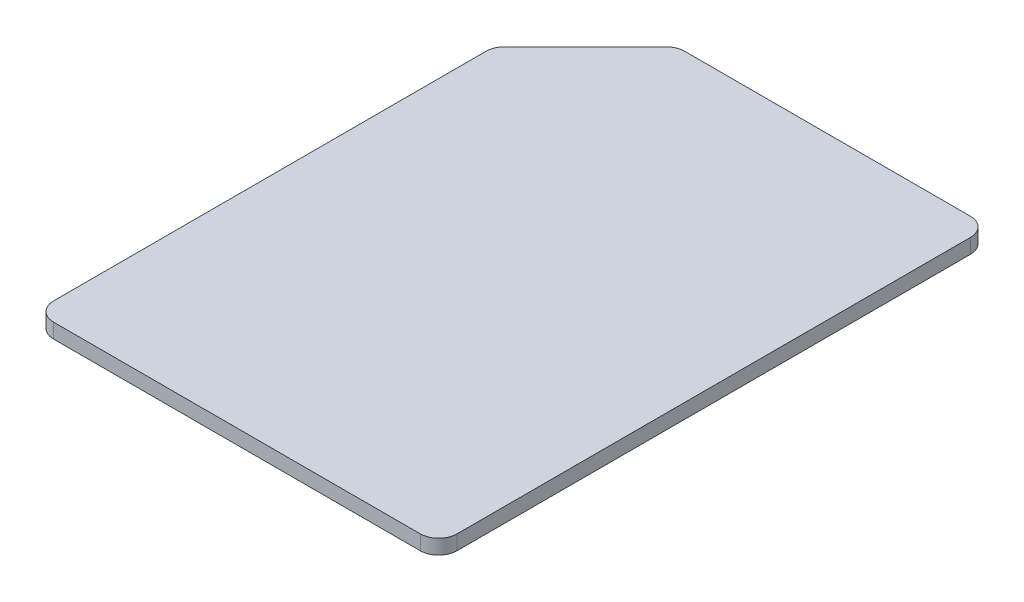
ISO-10303-21;
HEADER;
FILE_DESCRIPTION(('STEP AP214'),'2;1');
FILE_NAME('part.step','',(''),(''),'','','');
FILE_SCHEMA(('AUTOMOTIVE_DESIGN { 1 0 10303 214 1 1 1 1 }'));
ENDSEC;
DATA;
#1=APPLICATION_CONTEXT('core data for automotive mechanical design processes');
#2=APPLICATION_PROTOCOL_DEFINITION('international standard','automotive_design',2000,#1);
#3=PRODUCT_CONTEXT('',#1,'mechanical');
#4=PRODUCT('Part','Part','',(#3));
#5=PRODUCT_RELATED_PRODUCT_CATEGORY('part','',(#4));
#6=PRODUCT_DEFINITION_FORMATION('','',#4);
#7=PRODUCT_DEFINITION_CONTEXT('part definition',#1,'design');
#8=PRODUCT_DEFINITION('design','',#6,#7);
#9=PRODUCT_DEFINITION_SHAPE('','',#8);
#10=(LENGTH_UNIT() NAMED_UNIT(*) SI_UNIT(.MILLI.,.METRE.));
#11=(NAMED_UNIT(*) PLANE_ANGLE_UNIT() SI_UNIT($,.RADIAN.));
#12=(NAMED_UNIT(*) SI_UNIT($,.STERADIAN.) SOLID_ANGLE_UNIT());
#13=UNCERTAINTY_MEASURE_WITH_UNIT(LENGTH_MEASURE(1.E-05),#10,'distance_accuracy_value','');
#14=(GEOMETRIC_REPRESENTATION_CONTEXT(3) GLOBAL_UNCERTAINTY_ASSIGNED_CONTEXT((#13)) GLOBAL_UNIT_ASSIGNED_CONTEXT((#10,
#11,#12)) REPRESENTATION_CONTEXT('',''));
#15=CARTESIAN_POINT('',(0.,0.,0.));
#16=DIRECTION('',(0.,0.,1.));
#17=DIRECTION('',(1.,0.,0.));
#18=AXIS2_PLACEMENT_3D('',#15,#16,#17);
#19=CARTESIAN_POINT('',(5.5,0.4,7.5));
#20=DIRECTION('',(-1.,0.,0.));
#21=DIRECTION('',(0.,0.,1.));
#22=AXIS2_PLACEMENT_3D('',#19,#20,#21);
#23=PLANE('',#22);
#24=DIRECTION('',(0.,0.,-1.));
#25=VECTOR('',#24,1.);
#26=CARTESIAN_POINT('',(5.5,0.4,7.5));
#27=LINE('',#26,#25);
#28=CARTESIAN_POINT('',(5.5,0.4,7.));
#29=VERTEX_POINT('',#28);
#30=CARTESIAN_POINT('',(5.5,0.4,-7.));
#31=VERTEX_POINT('',#30);
#32=EDGE_CURVE('E144',#29,#31,#27,.T.);
#33=ORIENTED_EDGE('',*,*,#32,.F.);
#34=DIRECTION('',(0.,-1.,0.));
#35=VECTOR('',#34,1.);
#36=CARTESIAN_POINT('',(5.5,0.4,7.));
#37=LINE('',#36,#35);
#38=CARTESIAN_POINT('',(5.5,0.,7.));
#39=VERTEX_POINT('',#38);
#40=EDGE_CURVE('E128',#29,#39,#37,.T.);
#41=ORIENTED_EDGE('',*,*,#40,.T.);
#42=DIRECTION('',(0.,0.,-1.));
#43=VECTOR('',#42,1.);
#44=CARTESIAN_POINT('',(5.5,0.,7.5));
#45=LINE('',#44,#43);
#46=CARTESIAN_POINT('',(5.5,0.,-7.));
#47=VERTEX_POINT('',#46);
#48=EDGE_CURVE('E141',#39,#47,#45,.T.);
#49=ORIENTED_EDGE('',*,*,#48,.T.);
#50=DIRECTION('',(0.,-1.,0.));
#51=VECTOR('',#50,1.);
#52=CARTESIAN_POINT('',(5.5,0.4,-7.));
#53=LINE('',#52,#51);
#54=EDGE_CURVE('E147',#47,#31,#53,.F.);
#55=ORIENTED_EDGE('',*,*,#54,.T.);
#56=EDGE_LOOP('',(#33,#41,#49,#55));
#57=FACE_BOUND('',#56,.T.);
#58=ADVANCED_FACE('F45',(#57),#23,.F.);
#59=CARTESIAN_POINT('',(-5.5,0.4,-7.5));
#60=DIRECTION('',(0.,0.,1.));
#61=DIRECTION('',(1.,0.,0.));
#62=AXIS2_PLACEMENT_3D('',#59,#60,#61);
#63=PLANE('',#62);
#64=DIRECTION('',(-1.,0.,0.));
#65=VECTOR('',#64,1.);
#66=CARTESIAN_POINT('',(-5.5,0.4,-7.5));
#67=LINE('',#66,#65);
#68=CARTESIAN_POINT('',(5.,0.4,-7.5));
#69=VERTEX_POINT('',#68);
#70=CARTESIAN_POINT('',(-2.79289321881345,0.4,-7.5));
#71=VERTEX_POINT('',#70);
#72=EDGE_CURVE('E242',#69,#71,#67,.T.);
#73=ORIENTED_EDGE('',*,*,#72,.F.);
#74=DIRECTION('',(0.,-1.,0.));
#75=VECTOR('',#74,1.);
#76=CARTESIAN_POINT('',(5.,0.4,-7.5));
#77=LINE('',#76,#75);
#78=CARTESIAN_POINT('',(5.,0.,-7.5));
#79=VERTEX_POINT('',#78);
#80=EDGE_CURVE('E215',#69,#79,#77,.T.);
#81=ORIENTED_EDGE('',*,*,#80,.T.);
#82=DIRECTION('',(-1.,0.,0.));
#83=VECTOR('',#82,1.);
#84=CARTESIAN_POINT('',(-5.5,0.,-7.5));
#85=LINE('',#84,#83);
#86=CARTESIAN_POINT('',(-2.79289321881345,0.,-7.5));
#87=VERTEX_POINT('',#86);
#88=EDGE_CURVE('E153',#79,#87,#85,.T.);
#89=ORIENTED_EDGE('',*,*,#88,.T.);
#90=DIRECTION('',(0.,-1.,0.));
#91=VECTOR('',#90,1.);
#92=CARTESIAN_POINT('',(-2.79289321881345,0.4,-7.5));
#93=LINE('',#92,#91);
#94=EDGE_CURVE('E211',#87,#71,#93,.F.);
#95=ORIENTED_EDGE('',*,*,#94,.T.);
#96=EDGE_LOOP('',(#73,#81,#89,#95));
#97=FACE_BOUND('',#96,.T.);
#98=ADVANCED_FACE('F253',(#97),#63,.F.);
#99=CARTESIAN_POINT('',(-5.5,0.4,7.5));
#100=DIRECTION('',(1.,0.,0.));
#101=DIRECTION('',(0.,0.,-1.));
#102=AXIS2_PLACEMENT_3D('',#99,#100,#101);
#103=PLANE('',#102);
#104=DIRECTION('',(0.,0.,1.));
#105=VECTOR('',#104,1.);
#106=CARTESIAN_POINT('',(-5.5,0.,7.5));
#107=LINE('',#106,#105);
#108=CARTESIAN_POINT('',(-5.5,0.,-4.79289321881346));
#109=VERTEX_POINT('',#108);
#110=CARTESIAN_POINT('',(-5.5,0.,7.));
#111=VERTEX_POINT('',#110);
#112=EDGE_CURVE('E157',#109,#111,#107,.T.);
#113=ORIENTED_EDGE('',*,*,#112,.T.);
#114=DIRECTION('',(0.,-1.,0.));
#115=VECTOR('',#114,1.);
#116=CARTESIAN_POINT('',(-5.5,0.4,7.));
#117=LINE('',#116,#115);
#118=CARTESIAN_POINT('',(-5.5,0.4,7.));
#119=VERTEX_POINT('',#118);
#120=EDGE_CURVE('E61',#111,#119,#117,.F.);
#121=ORIENTED_EDGE('',*,*,#120,.T.);
#122=DIRECTION('',(0.,0.,1.));
#123=VECTOR('',#122,1.);
#124=CARTESIAN_POINT('',(-5.5,0.4,7.5));
#125=LINE('',#124,#123);
#126=CARTESIAN_POINT('',(-5.5,0.4,-4.79289321881346));
#127=VERTEX_POINT('',#126);
#128=EDGE_CURVE('E232',#127,#119,#125,.T.);
#129=ORIENTED_EDGE('',*,*,#128,.F.);
#130=DIRECTION('',(0.,1.,0.));
#131=VECTOR('',#130,1.);
#132=CARTESIAN_POINT('',(-5.5,0.,-4.79289321881346));
#133=LINE('',#132,#131);
#134=EDGE_CURVE('E205',#127,#109,#133,.F.);
#135=ORIENTED_EDGE('',*,*,#134,.T.);
#136=EDGE_LOOP('',(#113,#121,#129,#135));
#137=FACE_BOUND('',#136,.T.);
#138=ADVANCED_FACE('F231',(#137),#103,.F.);
#139=CARTESIAN_POINT('',(-5.5,0.4,7.5));
#140=DIRECTION('',(0.,0.,-1.));
#141=DIRECTION('',(-1.,0.,0.));
#142=AXIS2_PLACEMENT_3D('',#139,#140,#141);
#143=PLANE('',#142);
#144=DIRECTION('',(1.,0.,0.));
#145=VECTOR('',#144,1.);
#146=CARTESIAN_POINT('',(-5.5,0.,7.5));
#147=LINE('',#146,#145);
#148=CARTESIAN_POINT('',(-5.,0.,7.5));
#149=VERTEX_POINT('',#148);
#150=CARTESIAN_POINT('',(5.,0.,7.5));
#151=VERTEX_POINT('',#150);
#152=EDGE_CURVE('E165',#149,#151,#147,.T.);
#153=ORIENTED_EDGE('',*,*,#152,.T.);
#154=DIRECTION('',(0.,-1.,0.));
#155=VECTOR('',#154,1.);
#156=CARTESIAN_POINT('',(5.,0.4,7.5));
#157=LINE('',#156,#155);
#158=CARTESIAN_POINT('',(5.,0.4,7.5));
#159=VERTEX_POINT('',#158);
#160=EDGE_CURVE('E129',#151,#159,#157,.F.);
#161=ORIENTED_EDGE('',*,*,#160,.T.);
#162=DIRECTION('',(1.,0.,0.));
#163=VECTOR('',#162,1.);
#164=CARTESIAN_POINT('',(-5.5,0.4,7.5));
#165=LINE('',#164,#163);
#166=CARTESIAN_POINT('',(-5.,0.4,7.5));
#167=VERTEX_POINT('',#166);
#168=EDGE_CURVE('E160',#167,#159,#165,.T.);
#169=ORIENTED_EDGE('',*,*,#168,.F.);
#170=DIRECTION('',(0.,-1.,0.));
#171=VECTOR('',#170,1.);
#172=CARTESIAN_POINT('',(-5.,0.4,7.5));
#173=LINE('',#172,#171);
#174=EDGE_CURVE('E135',#167,#149,#173,.T.);
#175=ORIENTED_EDGE('',*,*,#174,.T.);
#176=EDGE_LOOP('',(#153,#161,#169,#175));
#177=FACE_BOUND('',#176,.T.);
#178=ADVANCED_FACE('F239',(#177),#143,.F.);
#179=CARTESIAN_POINT('',(0.,0.4,0.));
#180=DIRECTION('',(0.,-1.,0.));
#181=DIRECTION('',(0.,0.,-1.));
#182=AXIS2_PLACEMENT_3D('',#179,#180,#181);
#183=PLANE('',#182);
#184=ORIENTED_EDGE('',*,*,#168,.T.);
#185=CARTESIAN_POINT('',(5.,0.4,7.));
#186=DIRECTION('',(0.,-1.,0.));
#187=DIRECTION('',(0.,0.,-1.));
#188=AXIS2_PLACEMENT_3D('',#185,#186,#187);
#189=CIRCLE('',#188,0.5);
#190=EDGE_CURVE('E202',#159,#29,#189,.F.);
#191=ORIENTED_EDGE('',*,*,#190,.T.);
#192=ORIENTED_EDGE('',*,*,#32,.T.);
#193=CARTESIAN_POINT('',(5.,0.4,-7.));
#194=DIRECTION('',(0.,-1.,0.));
#195=DIRECTION('',(0.,0.,-1.));
#196=AXIS2_PLACEMENT_3D('',#193,#194,#195);
#197=CIRCLE('',#196,0.5);
#198=EDGE_CURVE('E196',#31,#69,#197,.F.);
#199=ORIENTED_EDGE('',*,*,#198,.T.);
#200=ORIENTED_EDGE('',*,*,#72,.T.);
#201=CARTESIAN_POINT('',(-2.79289321881345,0.4,-7.));
#202=DIRECTION('',(0.,-1.,0.));
#203=DIRECTION('',(0.,0.,-1.));
#204=AXIS2_PLACEMENT_3D('',#201,#202,#203);
#205=CIRCLE('',#204,0.5);
#206=CARTESIAN_POINT('',(-3.14644660940672,0.4,-7.35355339059327));
#207=VERTEX_POINT('',#206);
#208=EDGE_CURVE('E193',#71,#207,#205,.F.);
#209=ORIENTED_EDGE('',*,*,#208,.T.);
#210=DIRECTION('',(0.707106781186549,0.,-0.707106781186546));
#211=VECTOR('',#210,1.);
#212=CARTESIAN_POINT('',(-5.5,0.4,-5.));
#213=LINE('',#212,#211);
#214=CARTESIAN_POINT('',(-5.35355339059327,0.4,-5.14644660940673));
#215=VERTEX_POINT('',#214);
#216=EDGE_CURVE('E172',#207,#215,#213,.F.);
#217=ORIENTED_EDGE('',*,*,#216,.T.);
#218=CARTESIAN_POINT('',(-5.,0.4,-4.79289321881346));
#219=DIRECTION('',(0.,-1.,0.));
#220=DIRECTION('',(0.,0.,-1.));
#221=AXIS2_PLACEMENT_3D('',#218,#219,#220);
#222=CIRCLE('',#221,0.5);
#223=EDGE_CURVE('E68',#215,#127,#222,.F.);
#224=ORIENTED_EDGE('',*,*,#223,.T.);
#225=ORIENTED_EDGE('',*,*,#128,.T.);
#226=CARTESIAN_POINT('',(-5.,0.4,7.));
#227=DIRECTION('',(0.,-1.,0.));
#228=DIRECTION('',(0.,0.,-1.));
#229=AXIS2_PLACEMENT_3D('',#226,#227,#228);
#230=CIRCLE('',#229,0.5);
#231=EDGE_CURVE('E199',#119,#167,#230,.F.);
#232=ORIENTED_EDGE('',*,*,#231,.T.);
#233=EDGE_LOOP('',(#184,#191,#192,#199,#200,#209,#217,#224,#225,#232));
#234=FACE_BOUND('',#233,.T.);
#235=ADVANCED_FACE('F227',(#234),#183,.F.);
#236=CARTESIAN_POINT('',(0.,0.,0.));
#237=DIRECTION('',(0.,-1.,0.));
#238=DIRECTION('',(0.,0.,-1.));
#239=AXIS2_PLACEMENT_3D('',#236,#237,#238);
#240=PLANE('',#239);
#241=ORIENTED_EDGE('',*,*,#48,.F.);
#242=CARTESIAN_POINT('',(5.,0.,7.));
#243=DIRECTION('',(0.,-1.,0.));
#244=DIRECTION('',(0.,0.,-1.));
#245=AXIS2_PLACEMENT_3D('',#242,#243,#244);
#246=CIRCLE('',#245,0.5);
#247=EDGE_CURVE('E124',#39,#151,#246,.T.);
#248=ORIENTED_EDGE('',*,*,#247,.T.);
#249=ORIENTED_EDGE('',*,*,#152,.F.);
#250=CARTESIAN_POINT('',(-5.,0.,7.));
#251=DIRECTION('',(0.,-1.,0.));
#252=DIRECTION('',(0.,0.,-1.));
#253=AXIS2_PLACEMENT_3D('',#250,#251,#252);
#254=CIRCLE('',#253,0.5);
#255=EDGE_CURVE('E136',#149,#111,#254,.T.);
#256=ORIENTED_EDGE('',*,*,#255,.T.);
#257=ORIENTED_EDGE('',*,*,#112,.F.);
#258=CARTESIAN_POINT('',(-5.,0.,-4.79289321881346));
#259=DIRECTION('',(0.,-1.,0.));
#260=DIRECTION('',(0.,0.,-1.));
#261=AXIS2_PLACEMENT_3D('',#258,#259,#260);
#262=CIRCLE('',#261,0.5);
#263=CARTESIAN_POINT('',(-5.35355339059327,0.,-5.14644660940673));
#264=VERTEX_POINT('',#263);
#265=EDGE_CURVE('E146',#109,#264,#262,.T.);
#266=ORIENTED_EDGE('',*,*,#265,.T.);
#267=DIRECTION('',(-0.707106781186549,0.,0.707106781186546));
#268=VECTOR('',#267,1.);
#269=CARTESIAN_POINT('',(-5.24999999999999,0.,-5.25000000000001));
#270=LINE('',#269,#268);
#271=CARTESIAN_POINT('',(-3.14644660940672,0.,-7.35355339059327));
#272=VERTEX_POINT('',#271);
#273=EDGE_CURVE('E168',#264,#272,#270,.F.);
#274=ORIENTED_EDGE('',*,*,#273,.T.);
#275=CARTESIAN_POINT('',(-2.79289321881345,0.,-7.));
#276=DIRECTION('',(0.,-1.,0.));
#277=DIRECTION('',(0.,0.,-1.));
#278=AXIS2_PLACEMENT_3D('',#275,#276,#277);
#279=CIRCLE('',#278,0.5);
#280=EDGE_CURVE('E179',#272,#87,#279,.T.);
#281=ORIENTED_EDGE('',*,*,#280,.T.);
#282=ORIENTED_EDGE('',*,*,#88,.F.);
#283=CARTESIAN_POINT('',(5.,0.,-7.));
#284=DIRECTION('',(0.,-1.,0.));
#285=DIRECTION('',(0.,0.,-1.));
#286=AXIS2_PLACEMENT_3D('',#283,#284,#285);
#287=CIRCLE('',#286,0.5);
#288=EDGE_CURVE('E151',#79,#47,#287,.T.);
#289=ORIENTED_EDGE('',*,*,#288,.T.);
#290=EDGE_LOOP('',(#241,#248,#249,#256,#257,#266,#274,#281,#282,#289));
#291=FACE_BOUND('',#290,.T.);
#292=ADVANCED_FACE('F149',(#291),#240,.T.);
#293=CARTESIAN_POINT('',(-5.5,0.4,-5.));
#294=DIRECTION('',(0.707106781186546,0.,0.707106781186549));
#295=DIRECTION('',(0.,-1.,0.));
#296=AXIS2_PLACEMENT_3D('',#293,#294,#295);
#297=PLANE('',#296);
#298=ORIENTED_EDGE('',*,*,#216,.F.);
#299=DIRECTION('',(0.,1.,0.));
#300=VECTOR('',#299,1.);
#301=CARTESIAN_POINT('',(-3.14644660940672,0.,-7.35355339059327));
#302=LINE('',#301,#300);
#303=EDGE_CURVE('E11',#207,#272,#302,.F.);
#304=ORIENTED_EDGE('',*,*,#303,.T.);
#305=ORIENTED_EDGE('',*,*,#273,.F.);
#306=DIRECTION('',(0.,-1.,0.));
#307=VECTOR('',#306,1.);
#308=CARTESIAN_POINT('',(-5.35355339059327,0.4,-5.14644660940673));
#309=LINE('',#308,#307);
#310=EDGE_CURVE('E54',#264,#215,#309,.F.);
#311=ORIENTED_EDGE('',*,*,#310,.T.);
#312=EDGE_LOOP('',(#298,#304,#305,#311));
#313=FACE_BOUND('',#312,.T.);
#314=ADVANCED_FACE('F223',(#313),#297,.F.);
#315=CARTESIAN_POINT('',(5.,0.4,7.));
#316=DIRECTION('',(0.,-1.,0.));
#317=DIRECTION('',(0.,0.,-1.));
#318=AXIS2_PLACEMENT_3D('',#315,#316,#317);
#319=CYLINDRICAL_SURFACE('',#318,0.5);
#320=ORIENTED_EDGE('',*,*,#190,.F.);
#321=ORIENTED_EDGE('',*,*,#160,.F.);
#322=ORIENTED_EDGE('',*,*,#247,.F.);
#323=ORIENTED_EDGE('',*,*,#40,.F.);
#324=EDGE_LOOP('',(#320,#321,#322,#323));
#325=FACE_BOUND('',#324,.T.);
#326=ADVANCED_FACE('F127',(#325),#319,.T.);
#327=CARTESIAN_POINT('',(-5.,0.4,7.));
#328=DIRECTION('',(0.,-1.,0.));
#329=DIRECTION('',(0.,0.,-1.));
#330=AXIS2_PLACEMENT_3D('',#327,#328,#329);
#331=CYLINDRICAL_SURFACE('',#330,0.5);
#332=ORIENTED_EDGE('',*,*,#231,.F.);
#333=ORIENTED_EDGE('',*,*,#120,.F.);
#334=ORIENTED_EDGE('',*,*,#255,.F.);
#335=ORIENTED_EDGE('',*,*,#174,.F.);
#336=EDGE_LOOP('',(#332,#333,#334,#335));
#337=FACE_BOUND('',#336,.T.);
#338=ADVANCED_FACE('F236',(#337),#331,.T.);
#339=CARTESIAN_POINT('',(5.,0.4,-7.));
#340=DIRECTION('',(0.,-1.,0.));
#341=DIRECTION('',(0.,0.,-1.));
#342=AXIS2_PLACEMENT_3D('',#339,#340,#341);
#343=CYLINDRICAL_SURFACE('',#342,0.5);
#344=ORIENTED_EDGE('',*,*,#198,.F.);
#345=ORIENTED_EDGE('',*,*,#54,.F.);
#346=ORIENTED_EDGE('',*,*,#288,.F.);
#347=ORIENTED_EDGE('',*,*,#80,.F.);
#348=EDGE_LOOP('',(#344,#345,#346,#347));
#349=FACE_BOUND('',#348,.T.);
#350=ADVANCED_FACE('F251',(#349),#343,.T.);
#351=CARTESIAN_POINT('',(-2.79289321881345,0.4,-7.));
#352=DIRECTION('',(0.,1.,0.));
#353=DIRECTION('',(0.,0.,1.));
#354=AXIS2_PLACEMENT_3D('',#351,#352,#353);
#355=CYLINDRICAL_SURFACE('',#354,0.5);
#356=ORIENTED_EDGE('',*,*,#280,.F.);
#357=ORIENTED_EDGE('',*,*,#303,.F.);
#358=ORIENTED_EDGE('',*,*,#208,.F.);
#359=ORIENTED_EDGE('',*,*,#94,.F.);
#360=EDGE_LOOP('',(#356,#357,#358,#359));
#361=FACE_BOUND('',#360,.T.);
#362=ADVANCED_FACE('F257',(#361),#355,.T.);
#363=CARTESIAN_POINT('',(-5.,0.4,-4.79289321881346));
#364=DIRECTION('',(0.,-1.,0.));
#365=DIRECTION('',(0.,0.,-1.));
#366=AXIS2_PLACEMENT_3D('',#363,#364,#365);
#367=CYLINDRICAL_SURFACE('',#366,0.5);
#368=ORIENTED_EDGE('',*,*,#223,.F.);
#369=ORIENTED_EDGE('',*,*,#310,.F.);
#370=ORIENTED_EDGE('',*,*,#265,.F.);
#371=ORIENTED_EDGE('',*,*,#134,.F.);
#372=EDGE_LOOP('',(#368,#369,#370,#371));
#373=FACE_BOUND('',#372,.T.);
#374=ADVANCED_FACE('F47',(#373),#367,.T.);
#375=CLOSED_SHELL('',(#58,#98,#138,#178,#235,#292,#314,#326,#338,#350,#362,#374));
#376=MANIFOLD_SOLID_BREP('B2',#375);
#377=ADVANCED_BREP_SHAPE_REPRESENTATION('',(#18,#376),#14);
#378=SHAPE_DEFINITION_REPRESENTATION(#9,#377);
ENDSEC;
END-ISO-10303-21;
